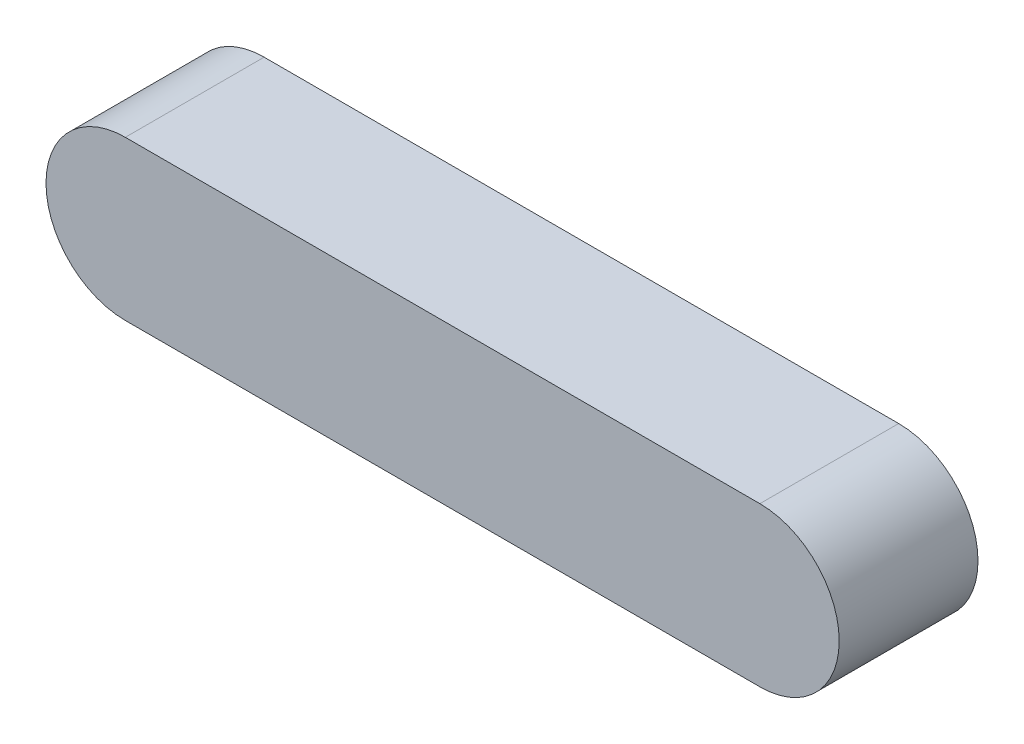
ISO-10303-21;
HEADER;
FILE_DESCRIPTION(('STEP AP214'),'2;1');
FILE_NAME('part.step','',(''),(''),'','','');
FILE_SCHEMA(('AUTOMOTIVE_DESIGN { 1 0 10303 214 1 1 1 1 }'));
ENDSEC;
DATA;
#1=APPLICATION_CONTEXT('core data for automotive mechanical design processes');
#2=APPLICATION_PROTOCOL_DEFINITION('international standard','automotive_design',2000,#1);
#3=PRODUCT_CONTEXT('',#1,'mechanical');
#4=PRODUCT('Part','Part','',(#3));
#5=PRODUCT_RELATED_PRODUCT_CATEGORY('part','',(#4));
#6=PRODUCT_DEFINITION_FORMATION('','',#4);
#7=PRODUCT_DEFINITION_CONTEXT('part definition',#1,'design');
#8=PRODUCT_DEFINITION('design','',#6,#7);
#9=PRODUCT_DEFINITION_SHAPE('','',#8);
#10=(LENGTH_UNIT() NAMED_UNIT(*) SI_UNIT(.MILLI.,.METRE.));
#11=(NAMED_UNIT(*) PLANE_ANGLE_UNIT() SI_UNIT($,.RADIAN.));
#12=(NAMED_UNIT(*) SI_UNIT($,.STERADIAN.) SOLID_ANGLE_UNIT());
#13=UNCERTAINTY_MEASURE_WITH_UNIT(LENGTH_MEASURE(1.E-05),#10,'distance_accuracy_value','');
#14=(GEOMETRIC_REPRESENTATION_CONTEXT(3) GLOBAL_UNCERTAINTY_ASSIGNED_CONTEXT((#13)) GLOBAL_UNIT_ASSIGNED_CONTEXT((#10,
#11,#12)) REPRESENTATION_CONTEXT('',''));
#15=CARTESIAN_POINT('',(0.,0.,0.));
#16=DIRECTION('',(0.,0.,1.));
#17=DIRECTION('',(1.,0.,0.));
#18=AXIS2_PLACEMENT_3D('',#15,#16,#17);
#19=CARTESIAN_POINT('',(0.,0.,7.));
#20=DIRECTION('',(0.,0.,-1.));
#21=DIRECTION('',(-1.,0.,0.));
#22=AXIS2_PLACEMENT_3D('',#19,#20,#21);
#23=CYLINDRICAL_SURFACE('',#22,4.);
#24=CARTESIAN_POINT('',(0.,0.,0.));
#25=DIRECTION('',(0.,0.,1.));
#26=DIRECTION('',(1.,0.,0.));
#27=AXIS2_PLACEMENT_3D('',#24,#25,#26);
#28=CIRCLE('',#27,4.);
#29=CARTESIAN_POINT('',(0.,4.,0.));
#30=VERTEX_POINT('',#29);
#31=CARTESIAN_POINT('',(0.,-4.,0.));
#32=VERTEX_POINT('',#31);
#33=EDGE_CURVE('E99',#30,#32,#28,.T.);
#34=ORIENTED_EDGE('',*,*,#33,.T.);
#35=DIRECTION('',(0.,0.,-1.));
#36=VECTOR('',#35,1.);
#37=CARTESIAN_POINT('',(0.,-4.,7.));
#38=LINE('',#37,#36);
#39=CARTESIAN_POINT('',(0.,-4.,7.));
#40=VERTEX_POINT('',#39);
#41=EDGE_CURVE('E11',#40,#32,#38,.T.);
#42=ORIENTED_EDGE('',*,*,#41,.F.);
#43=CARTESIAN_POINT('',(0.,0.,7.));
#44=DIRECTION('',(0.,0.,1.));
#45=DIRECTION('',(1.,0.,0.));
#46=AXIS2_PLACEMENT_3D('',#43,#44,#45);
#47=CIRCLE('',#46,4.);
#48=CARTESIAN_POINT('',(0.,4.,7.));
#49=VERTEX_POINT('',#48);
#50=EDGE_CURVE('E87',#49,#40,#47,.T.);
#51=ORIENTED_EDGE('',*,*,#50,.F.);
#52=DIRECTION('',(0.,0.,-1.));
#53=VECTOR('',#52,1.);
#54=CARTESIAN_POINT('',(0.,4.,7.));
#55=LINE('',#54,#53);
#56=EDGE_CURVE('E95',#49,#30,#55,.T.);
#57=ORIENTED_EDGE('',*,*,#56,.T.);
#58=EDGE_LOOP('',(#34,#42,#51,#57));
#59=FACE_BOUND('',#58,.T.);
#60=ADVANCED_FACE('F36',(#59),#23,.T.);
#61=CARTESIAN_POINT('',(0.,-4.,7.));
#62=DIRECTION('',(0.,1.,0.));
#63=DIRECTION('',(0.,0.,1.));
#64=AXIS2_PLACEMENT_3D('',#61,#62,#63);
#65=PLANE('',#64);
#66=DIRECTION('',(1.,0.,0.));
#67=VECTOR('',#66,1.);
#68=CARTESIAN_POINT('',(0.,-4.,0.));
#69=LINE('',#68,#67);
#70=CARTESIAN_POINT('',(32.,-4.,0.));
#71=VERTEX_POINT('',#70);
#72=EDGE_CURVE('E91',#32,#71,#69,.T.);
#73=ORIENTED_EDGE('',*,*,#72,.T.);
#74=DIRECTION('',(0.,0.,-1.));
#75=VECTOR('',#74,1.);
#76=CARTESIAN_POINT('',(32.,-4.,7.));
#77=LINE('',#76,#75);
#78=CARTESIAN_POINT('',(32.,-4.,7.));
#79=VERTEX_POINT('',#78);
#80=EDGE_CURVE('E44',#79,#71,#77,.T.);
#81=ORIENTED_EDGE('',*,*,#80,.F.);
#82=DIRECTION('',(1.,0.,0.));
#83=VECTOR('',#82,1.);
#84=CARTESIAN_POINT('',(0.,-4.,7.));
#85=LINE('',#84,#83);
#86=EDGE_CURVE('E82',#40,#79,#85,.T.);
#87=ORIENTED_EDGE('',*,*,#86,.F.);
#88=ORIENTED_EDGE('',*,*,#41,.T.);
#89=EDGE_LOOP('',(#73,#81,#87,#88));
#90=FACE_BOUND('',#89,.T.);
#91=ADVANCED_FACE('F90',(#90),#65,.F.);
#92=CARTESIAN_POINT('',(32.,0.,7.));
#93=DIRECTION('',(0.,0.,-1.));
#94=DIRECTION('',(-1.,0.,0.));
#95=AXIS2_PLACEMENT_3D('',#92,#93,#94);
#96=CYLINDRICAL_SURFACE('',#95,4.);
#97=CARTESIAN_POINT('',(32.,0.,0.));
#98=DIRECTION('',(0.,0.,1.));
#99=DIRECTION('',(1.,0.,0.));
#100=AXIS2_PLACEMENT_3D('',#97,#98,#99);
#101=CIRCLE('',#100,4.);
#102=CARTESIAN_POINT('',(32.,4.,0.));
#103=VERTEX_POINT('',#102);
#104=EDGE_CURVE('E69',#71,#103,#101,.T.);
#105=ORIENTED_EDGE('',*,*,#104,.T.);
#106=DIRECTION('',(0.,0.,-1.));
#107=VECTOR('',#106,1.);
#108=CARTESIAN_POINT('',(32.,4.,7.));
#109=LINE('',#108,#107);
#110=CARTESIAN_POINT('',(32.,4.,7.));
#111=VERTEX_POINT('',#110);
#112=EDGE_CURVE('E92',#111,#103,#109,.T.);
#113=ORIENTED_EDGE('',*,*,#112,.F.);
#114=CARTESIAN_POINT('',(32.,0.,7.));
#115=DIRECTION('',(0.,0.,1.));
#116=DIRECTION('',(1.,0.,0.));
#117=AXIS2_PLACEMENT_3D('',#114,#115,#116);
#118=CIRCLE('',#117,4.);
#119=EDGE_CURVE('E85',#79,#111,#118,.T.);
#120=ORIENTED_EDGE('',*,*,#119,.F.);
#121=ORIENTED_EDGE('',*,*,#80,.T.);
#122=EDGE_LOOP('',(#105,#113,#120,#121));
#123=FACE_BOUND('',#122,.T.);
#124=ADVANCED_FACE('F93',(#123),#96,.T.);
#125=CARTESIAN_POINT('',(0.,4.,7.));
#126=DIRECTION('',(0.,-1.,0.));
#127=DIRECTION('',(0.,0.,-1.));
#128=AXIS2_PLACEMENT_3D('',#125,#126,#127);
#129=PLANE('',#128);
#130=DIRECTION('',(-1.,0.,0.));
#131=VECTOR('',#130,1.);
#132=CARTESIAN_POINT('',(0.,4.,0.));
#133=LINE('',#132,#131);
#134=EDGE_CURVE('E75',#103,#30,#133,.T.);
#135=ORIENTED_EDGE('',*,*,#134,.T.);
#136=ORIENTED_EDGE('',*,*,#56,.F.);
#137=DIRECTION('',(-1.,0.,0.));
#138=VECTOR('',#137,1.);
#139=CARTESIAN_POINT('',(0.,4.,7.));
#140=LINE('',#139,#138);
#141=EDGE_CURVE('E52',#111,#49,#140,.T.);
#142=ORIENTED_EDGE('',*,*,#141,.F.);
#143=ORIENTED_EDGE('',*,*,#112,.T.);
#144=EDGE_LOOP('',(#135,#136,#142,#143));
#145=FACE_BOUND('',#144,.T.);
#146=ADVANCED_FACE('F106',(#145),#129,.F.);
#147=CARTESIAN_POINT('',(0.,0.,7.));
#148=DIRECTION('',(0.,0.,1.));
#149=DIRECTION('',(1.,0.,0.));
#150=AXIS2_PLACEMENT_3D('',#147,#148,#149);
#151=PLANE('',#150);
#152=ORIENTED_EDGE('',*,*,#50,.T.);
#153=ORIENTED_EDGE('',*,*,#86,.T.);
#154=ORIENTED_EDGE('',*,*,#119,.T.);
#155=ORIENTED_EDGE('',*,*,#141,.T.);
#156=EDGE_LOOP('',(#152,#153,#154,#155));
#157=FACE_BOUND('',#156,.T.);
#158=ADVANCED_FACE('F83',(#157),#151,.T.);
#159=CARTESIAN_POINT('',(0.,0.,0.));
#160=DIRECTION('',(0.,0.,1.));
#161=DIRECTION('',(1.,0.,0.));
#162=AXIS2_PLACEMENT_3D('',#159,#160,#161);
#163=PLANE('',#162);
#164=ORIENTED_EDGE('',*,*,#33,.F.);
#165=ORIENTED_EDGE('',*,*,#134,.F.);
#166=ORIENTED_EDGE('',*,*,#104,.F.);
#167=ORIENTED_EDGE('',*,*,#72,.F.);
#168=EDGE_LOOP('',(#164,#165,#166,#167));
#169=FACE_BOUND('',#168,.T.);
#170=ADVANCED_FACE('F109',(#169),#163,.F.);
#171=CLOSED_SHELL('',(#60,#91,#124,#146,#158,#170));
#172=MANIFOLD_SOLID_BREP('B2',#171);
#173=ADVANCED_BREP_SHAPE_REPRESENTATION('',(#18,#172),#14);
#174=SHAPE_DEFINITION_REPRESENTATION(#9,#173);
ENDSEC;
END-ISO-10303-21;
